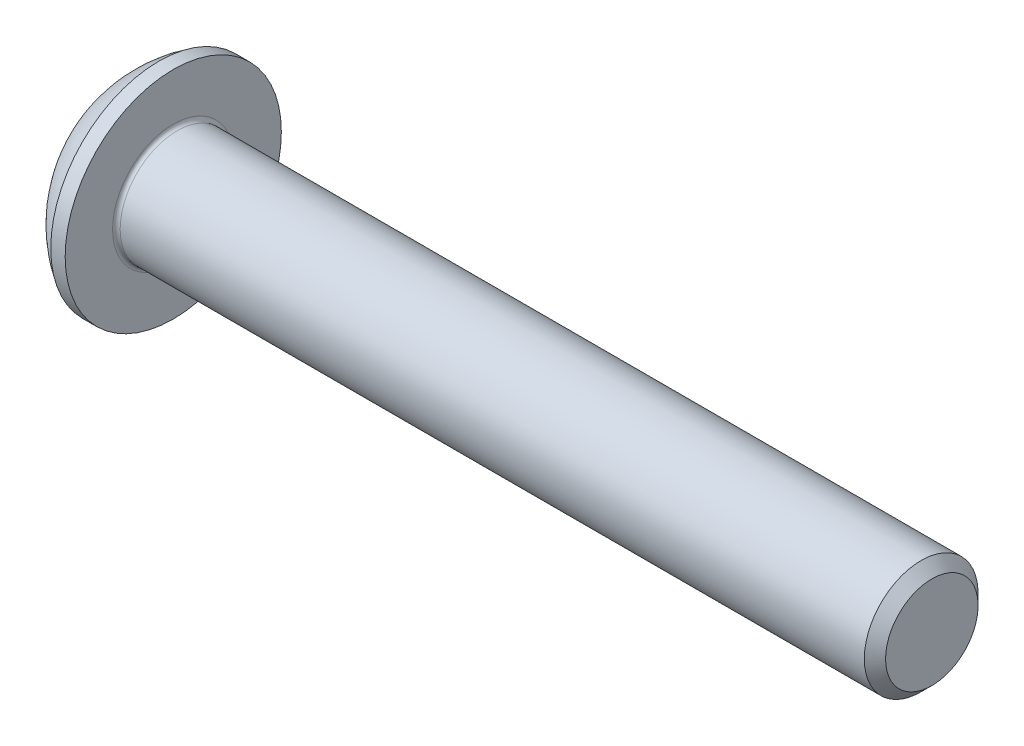
ISO-10303-21;
HEADER;
FILE_DESCRIPTION(('STEP AP214'),'2;1');
FILE_NAME('part.step','',(''),(''),'','','');
FILE_SCHEMA(('AUTOMOTIVE_DESIGN { 1 0 10303 214 1 1 1 1 }'));
ENDSEC;
DATA;
#1=APPLICATION_CONTEXT('core data for automotive mechanical design processes');
#2=APPLICATION_PROTOCOL_DEFINITION('international standard','automotive_design',2000,#1);
#3=PRODUCT_CONTEXT('',#1,'mechanical');
#4=PRODUCT('Part','Part','',(#3));
#5=PRODUCT_RELATED_PRODUCT_CATEGORY('part','',(#4));
#6=PRODUCT_DEFINITION_FORMATION('','',#4);
#7=PRODUCT_DEFINITION_CONTEXT('part definition',#1,'design');
#8=PRODUCT_DEFINITION('design','',#6,#7);
#9=PRODUCT_DEFINITION_SHAPE('','',#8);
#10=(LENGTH_UNIT() NAMED_UNIT(*) SI_UNIT(.MILLI.,.METRE.));
#11=(NAMED_UNIT(*) PLANE_ANGLE_UNIT() SI_UNIT($,.RADIAN.));
#12=(NAMED_UNIT(*) SI_UNIT($,.STERADIAN.) SOLID_ANGLE_UNIT());
#13=UNCERTAINTY_MEASURE_WITH_UNIT(LENGTH_MEASURE(1.E-05),#10,'distance_accuracy_value','');
#14=(GEOMETRIC_REPRESENTATION_CONTEXT(3) GLOBAL_UNCERTAINTY_ASSIGNED_CONTEXT((#13)) GLOBAL_UNIT_ASSIGNED_CONTEXT((#10,
#11,#12)) REPRESENTATION_CONTEXT('',''));
#15=CARTESIAN_POINT('',(0.,0.,0.));
#16=DIRECTION('',(0.,0.,1.));
#17=DIRECTION('',(1.,0.,0.));
#18=AXIS2_PLACEMENT_3D('',#15,#16,#17);
#19=CARTESIAN_POINT('',(0.,0.,0.));
#20=DIRECTION('',(-1.,0.,0.));
#21=DIRECTION('',(0.,0.,1.));
#22=AXIS2_PLACEMENT_3D('',#19,#20,#21);
#23=PLANE('',#22);
#24=CARTESIAN_POINT('',(0.,0.,0.));
#25=DIRECTION('',(-1.,0.,0.));
#26=DIRECTION('',(0.,0.,1.));
#27=AXIS2_PLACEMENT_3D('',#24,#25,#26);
#28=CIRCLE('',#27,1.425);
#29=CARTESIAN_POINT('',(0.,0.,1.425));
#30=VERTEX_POINT('',#29);
#31=EDGE_CURVE('E152',#30,#30,#28,.T.);
#32=ORIENTED_EDGE('',*,*,#31,.T.);
#33=EDGE_LOOP('',(#32));
#34=FACE_BOUND('',#33,.T.);
#35=DIRECTION('',(0.,-1.,0.));
#36=VECTOR('',#35,1.);
#37=CARTESIAN_POINT('',(0.,-0.577350269189625,1.));
#38=LINE('',#37,#36);
#39=CARTESIAN_POINT('',(0.,0.577350269189626,1.));
#40=VERTEX_POINT('',#39);
#41=CARTESIAN_POINT('',(0.,-0.577350269189625,1.));
#42=VERTEX_POINT('',#41);
#43=EDGE_CURVE('E47',#40,#42,#38,.T.);
#44=ORIENTED_EDGE('',*,*,#43,.T.);
#45=DIRECTION('',(0.,-0.5,-0.866025403784439));
#46=VECTOR('',#45,1.);
#47=CARTESIAN_POINT('',(0.,-1.15470053837925,0.));
#48=LINE('',#47,#46);
#49=CARTESIAN_POINT('',(0.,-1.15470053837925,0.));
#50=VERTEX_POINT('',#49);
#51=EDGE_CURVE('E272',#42,#50,#48,.T.);
#52=ORIENTED_EDGE('',*,*,#51,.T.);
#53=DIRECTION('',(0.,0.5,-0.866025403784439));
#54=VECTOR('',#53,1.);
#55=CARTESIAN_POINT('',(0.,-0.577350269189625,-1.));
#56=LINE('',#55,#54);
#57=CARTESIAN_POINT('',(0.,-0.577350269189625,-1.));
#58=VERTEX_POINT('',#57);
#59=EDGE_CURVE('E127',#50,#58,#56,.T.);
#60=ORIENTED_EDGE('',*,*,#59,.T.);
#61=DIRECTION('',(0.,1.,0.));
#62=VECTOR('',#61,1.);
#63=CARTESIAN_POINT('',(0.,0.577350269189626,-1.));
#64=LINE('',#63,#62);
#65=CARTESIAN_POINT('',(0.,0.577350269189626,-1.));
#66=VERTEX_POINT('',#65);
#67=EDGE_CURVE('E275',#58,#66,#64,.T.);
#68=ORIENTED_EDGE('',*,*,#67,.T.);
#69=DIRECTION('',(0.,0.5,0.866025403784439));
#70=VECTOR('',#69,1.);
#71=CARTESIAN_POINT('',(0.,1.15470053837925,0.));
#72=LINE('',#71,#70);
#73=CARTESIAN_POINT('',(0.,1.15470053837925,0.));
#74=VERTEX_POINT('',#73);
#75=EDGE_CURVE('E277',#66,#74,#72,.T.);
#76=ORIENTED_EDGE('',*,*,#75,.T.);
#77=DIRECTION('',(0.,-0.5,0.866025403784439));
#78=VECTOR('',#77,1.);
#79=CARTESIAN_POINT('',(0.,0.577350269189626,1.));
#80=LINE('',#79,#78);
#81=EDGE_CURVE('E279',#74,#40,#80,.T.);
#82=ORIENTED_EDGE('',*,*,#81,.T.);
#83=EDGE_LOOP('',(#44,#52,#60,#68,#76,#82));
#84=FACE_BOUND('',#83,.T.);
#85=ADVANCED_FACE('F32',(#34,#84),#23,.T.);
#86=CARTESIAN_POINT('',(3.03337598425197,0.,0.));
#87=DIRECTION('',(-1.,0.,0.));
#88=DIRECTION('',(0.,1.,0.));
#89=AXIS2_PLACEMENT_3D('',#86,#87,#88);
#90=SPHERICAL_SURFACE('',#89,3.35141684393879);
#91=CARTESIAN_POINT('',(1.27,0.,0.));
#92=DIRECTION('',(-1.,0.,0.));
#93=DIRECTION('',(0.,0.,1.));
#94=AXIS2_PLACEMENT_3D('',#91,#92,#93);
#95=CIRCLE('',#94,2.85);
#96=CARTESIAN_POINT('',(1.27,0.,2.85));
#97=VERTEX_POINT('',#96);
#98=EDGE_CURVE('E149',#97,#97,#95,.T.);
#99=ORIENTED_EDGE('',*,*,#98,.T.);
#100=EDGE_LOOP('',(#99));
#101=FACE_BOUND('',#100,.T.);
#102=ORIENTED_EDGE('',*,*,#31,.F.);
#103=EDGE_LOOP('',(#102));
#104=FACE_BOUND('',#103,.T.);
#105=ADVANCED_FACE('F173',(#101,#104),#90,.T.);
#106=CARTESIAN_POINT('',(0.,0.,0.));
#107=DIRECTION('',(-1.,0.,0.));
#108=DIRECTION('',(0.,0.,1.));
#109=AXIS2_PLACEMENT_3D('',#106,#107,#108);
#110=CYLINDRICAL_SURFACE('',#109,2.85);
#111=ORIENTED_EDGE('',*,*,#98,.F.);
#112=EDGE_LOOP('',(#111));
#113=FACE_BOUND('',#112,.T.);
#114=CARTESIAN_POINT('',(1.65,0.,0.));
#115=DIRECTION('',(-1.,0.,0.));
#116=DIRECTION('',(0.,0.,1.));
#117=AXIS2_PLACEMENT_3D('',#114,#115,#116);
#118=CIRCLE('',#117,2.85);
#119=CARTESIAN_POINT('',(1.65,0.,2.85));
#120=VERTEX_POINT('',#119);
#121=EDGE_CURVE('E146',#120,#120,#118,.T.);
#122=ORIENTED_EDGE('',*,*,#121,.T.);
#123=EDGE_LOOP('',(#122));
#124=FACE_BOUND('',#123,.T.);
#125=ADVANCED_FACE('F178',(#113,#124),#110,.T.);
#126=CARTESIAN_POINT('',(1.65,1.5,0.));
#127=DIRECTION('',(-1.,0.,0.));
#128=DIRECTION('',(0.,0.,1.));
#129=AXIS2_PLACEMENT_3D('',#126,#127,#128);
#130=PLANE('',#129);
#131=CARTESIAN_POINT('',(1.65,0.,0.));
#132=DIRECTION('',(-1.,0.,0.));
#133=DIRECTION('',(0.,0.,1.));
#134=AXIS2_PLACEMENT_3D('',#131,#132,#133);
#135=CIRCLE('',#134,1.6);
#136=CARTESIAN_POINT('',(1.65,0.,1.6));
#137=VERTEX_POINT('',#136);
#138=EDGE_CURVE('E40',#137,#137,#135,.T.);
#139=ORIENTED_EDGE('',*,*,#138,.T.);
#140=EDGE_LOOP('',(#139));
#141=FACE_BOUND('',#140,.T.);
#142=ORIENTED_EDGE('',*,*,#121,.F.);
#143=EDGE_LOOP('',(#142));
#144=FACE_BOUND('',#143,.T.);
#145=ADVANCED_FACE('F157',(#141,#144),#130,.F.);
#146=CARTESIAN_POINT('',(0.,0.,0.));
#147=DIRECTION('',(-1.,0.,0.));
#148=DIRECTION('',(0.,0.,1.));
#149=AXIS2_PLACEMENT_3D('',#146,#147,#148);
#150=CYLINDRICAL_SURFACE('',#149,1.5);
#151=CARTESIAN_POINT('',(1.75,0.,0.));
#152=DIRECTION('',(-1.,0.,0.));
#153=DIRECTION('',(0.,0.,1.));
#154=AXIS2_PLACEMENT_3D('',#151,#152,#153);
#155=CIRCLE('',#154,1.5);
#156=CARTESIAN_POINT('',(1.75,0.,1.5));
#157=VERTEX_POINT('',#156);
#158=EDGE_CURVE('E11',#157,#157,#155,.F.);
#159=ORIENTED_EDGE('',*,*,#158,.T.);
#160=EDGE_LOOP('',(#159));
#161=FACE_BOUND('',#160,.T.);
#162=CARTESIAN_POINT('',(21.3695,0.,0.));
#163=DIRECTION('',(-1.,0.,0.));
#164=DIRECTION('',(0.,0.,1.));
#165=AXIS2_PLACEMENT_3D('',#162,#163,#164);
#166=CIRCLE('',#165,1.5);
#167=CARTESIAN_POINT('',(21.3695,0.,1.5));
#168=VERTEX_POINT('',#167);
#169=EDGE_CURVE('E143',#168,#168,#166,.T.);
#170=ORIENTED_EDGE('',*,*,#169,.T.);
#171=EDGE_LOOP('',(#170));
#172=FACE_BOUND('',#171,.T.);
#173=ADVANCED_FACE('F187',(#161,#172),#150,.T.);
#174=CARTESIAN_POINT('',(21.65,0.,0.));
#175=DIRECTION('',(-1.,0.,0.));
#176=DIRECTION('',(0.,0.,1.));
#177=AXIS2_PLACEMENT_3D('',#174,#175,#176);
#178=CONICAL_SURFACE('',#177,1.2195,0.785398163397452);
#179=ORIENTED_EDGE('',*,*,#169,.F.);
#180=EDGE_LOOP('',(#179));
#181=FACE_BOUND('',#180,.T.);
#182=CARTESIAN_POINT('',(21.65,0.,0.));
#183=DIRECTION('',(-1.,0.,0.));
#184=DIRECTION('',(0.,0.,1.));
#185=AXIS2_PLACEMENT_3D('',#182,#183,#184);
#186=CIRCLE('',#185,1.2195);
#187=CARTESIAN_POINT('',(21.65,0.,1.2195));
#188=VERTEX_POINT('',#187);
#189=EDGE_CURVE('E139',#188,#188,#186,.T.);
#190=ORIENTED_EDGE('',*,*,#189,.T.);
#191=EDGE_LOOP('',(#190));
#192=FACE_BOUND('',#191,.T.);
#193=ADVANCED_FACE('F168',(#181,#192),#178,.T.);
#194=CARTESIAN_POINT('',(21.65,0.,0.));
#195=DIRECTION('',(-1.,0.,0.));
#196=DIRECTION('',(0.,0.,1.));
#197=AXIS2_PLACEMENT_3D('',#194,#195,#196);
#198=PLANE('',#197);
#199=ORIENTED_EDGE('',*,*,#189,.F.);
#200=EDGE_LOOP('',(#199));
#201=FACE_BOUND('',#200,.T.);
#202=ADVANCED_FACE('F161',(#201),#198,.F.);
#203=CARTESIAN_POINT('',(1.75,0.,0.));
#204=DIRECTION('',(-1.,0.,0.));
#205=DIRECTION('',(0.,0.,1.));
#206=AXIS2_PLACEMENT_3D('',#203,#204,#205);
#207=TOROIDAL_SURFACE('',#206,1.6,0.1);
#208=ORIENTED_EDGE('',*,*,#158,.F.);
#209=EDGE_LOOP('',(#208));
#210=FACE_BOUND('',#209,.T.);
#211=ORIENTED_EDGE('',*,*,#138,.F.);
#212=EDGE_LOOP('',(#211));
#213=FACE_BOUND('',#212,.T.);
#214=ADVANCED_FACE('F34',(#210,#213),#207,.F.);
#215=CARTESIAN_POINT('',(1.04,-1.15470053837925,0.));
#216=DIRECTION('',(0.,0.866025403784439,-0.5));
#217=DIRECTION('',(0.,0.5,0.866025403784439));
#218=AXIS2_PLACEMENT_3D('',#215,#216,#217);
#219=PLANE('',#218);
#220=DIRECTION('',(0.,-0.5,-0.866025403784439));
#221=VECTOR('',#220,1.);
#222=CARTESIAN_POINT('',(1.04,-1.15470053837925,0.));
#223=LINE('',#222,#221);
#224=CARTESIAN_POINT('',(1.04,-0.577350269189625,1.));
#225=VERTEX_POINT('',#224);
#226=CARTESIAN_POINT('',(1.04,-0.866025403784438,0.5));
#227=VERTEX_POINT('',#226);
#228=EDGE_CURVE('E113',#225,#227,#223,.T.);
#229=ORIENTED_EDGE('',*,*,#228,.T.);
#230=CARTESIAN_POINT('',(1.04,-1.15470053837925,0.));
#231=VERTEX_POINT('',#230);
#232=EDGE_CURVE('E108',#227,#231,#223,.T.);
#233=ORIENTED_EDGE('',*,*,#232,.T.);
#234=DIRECTION('',(-1.,0.,0.));
#235=VECTOR('',#234,1.);
#236=CARTESIAN_POINT('',(1.04,-1.15470053837925,0.));
#237=LINE('',#236,#235);
#238=EDGE_CURVE('E110',#231,#50,#237,.T.);
#239=ORIENTED_EDGE('',*,*,#238,.T.);
#240=ORIENTED_EDGE('',*,*,#51,.F.);
#241=DIRECTION('',(-1.,0.,0.));
#242=VECTOR('',#241,1.);
#243=CARTESIAN_POINT('',(1.04,-0.577350269189625,1.));
#244=LINE('',#243,#242);
#245=EDGE_CURVE('E268',#225,#42,#244,.T.);
#246=ORIENTED_EDGE('',*,*,#245,.F.);
#247=EDGE_LOOP('',(#229,#233,#239,#240,#246));
#248=FACE_BOUND('',#247,.T.);
#249=ADVANCED_FACE('F109',(#248),#219,.T.);
#250=CARTESIAN_POINT('',(1.04,-0.577350269189625,-1.));
#251=DIRECTION('',(0.,0.866025403784439,0.5));
#252=DIRECTION('',(0.,-0.5,0.866025403784439));
#253=AXIS2_PLACEMENT_3D('',#250,#251,#252);
#254=PLANE('',#253);
#255=DIRECTION('',(0.,0.5,-0.866025403784439));
#256=VECTOR('',#255,1.);
#257=CARTESIAN_POINT('',(1.04,-0.577350269189625,-1.));
#258=LINE('',#257,#256);
#259=CARTESIAN_POINT('',(1.04,-0.866025403784439,-0.5));
#260=VERTEX_POINT('',#259);
#261=EDGE_CURVE('E55',#231,#260,#258,.T.);
#262=ORIENTED_EDGE('',*,*,#261,.T.);
#263=CARTESIAN_POINT('',(1.04,-0.577350269189625,-1.));
#264=VERTEX_POINT('',#263);
#265=EDGE_CURVE('E122',#260,#264,#258,.T.);
#266=ORIENTED_EDGE('',*,*,#265,.T.);
#267=DIRECTION('',(-1.,0.,0.));
#268=VECTOR('',#267,1.);
#269=CARTESIAN_POINT('',(1.04,-0.577350269189625,-1.));
#270=LINE('',#269,#268);
#271=EDGE_CURVE('E129',#264,#58,#270,.T.);
#272=ORIENTED_EDGE('',*,*,#271,.T.);
#273=ORIENTED_EDGE('',*,*,#59,.F.);
#274=ORIENTED_EDGE('',*,*,#238,.F.);
#275=EDGE_LOOP('',(#262,#266,#272,#273,#274));
#276=FACE_BOUND('',#275,.T.);
#277=ADVANCED_FACE('F125',(#276),#254,.T.);
#278=CARTESIAN_POINT('',(1.04,0.577350269189626,-1.));
#279=DIRECTION('',(0.,0.,1.));
#280=DIRECTION('',(1.,0.,0.));
#281=AXIS2_PLACEMENT_3D('',#278,#279,#280);
#282=PLANE('',#281);
#283=DIRECTION('',(0.,1.,0.));
#284=VECTOR('',#283,1.);
#285=CARTESIAN_POINT('',(1.04,0.577350269189626,-1.));
#286=LINE('',#285,#284);
#287=CARTESIAN_POINT('',(1.04,0.,-1.));
#288=VERTEX_POINT('',#287);
#289=EDGE_CURVE('E249',#264,#288,#286,.T.);
#290=ORIENTED_EDGE('',*,*,#289,.T.);
#291=CARTESIAN_POINT('',(1.04,0.577350269189626,-1.));
#292=VERTEX_POINT('',#291);
#293=EDGE_CURVE('E121',#288,#292,#286,.T.);
#294=ORIENTED_EDGE('',*,*,#293,.T.);
#295=DIRECTION('',(-1.,0.,0.));
#296=VECTOR('',#295,1.);
#297=CARTESIAN_POINT('',(1.04,0.577350269189626,-1.));
#298=LINE('',#297,#296);
#299=EDGE_CURVE('E134',#292,#66,#298,.T.);
#300=ORIENTED_EDGE('',*,*,#299,.T.);
#301=ORIENTED_EDGE('',*,*,#67,.F.);
#302=ORIENTED_EDGE('',*,*,#271,.F.);
#303=EDGE_LOOP('',(#290,#294,#300,#301,#302));
#304=FACE_BOUND('',#303,.T.);
#305=ADVANCED_FACE('F201',(#304),#282,.T.);
#306=CARTESIAN_POINT('',(1.04,1.15470053837925,0.));
#307=DIRECTION('',(0.,-0.866025403784439,0.5));
#308=DIRECTION('',(0.,-0.5,-0.866025403784439));
#309=AXIS2_PLACEMENT_3D('',#306,#307,#308);
#310=PLANE('',#309);
#311=DIRECTION('',(0.,0.5,0.866025403784439));
#312=VECTOR('',#311,1.);
#313=CARTESIAN_POINT('',(1.04,1.15470053837925,0.));
#314=LINE('',#313,#312);
#315=CARTESIAN_POINT('',(1.04,0.866025403784439,-0.5));
#316=VERTEX_POINT('',#315);
#317=EDGE_CURVE('E238',#292,#316,#314,.T.);
#318=ORIENTED_EDGE('',*,*,#317,.T.);
#319=CARTESIAN_POINT('',(1.04,1.15470053837925,0.));
#320=VERTEX_POINT('',#319);
#321=EDGE_CURVE('E243',#316,#320,#314,.T.);
#322=ORIENTED_EDGE('',*,*,#321,.T.);
#323=DIRECTION('',(-1.,0.,0.));
#324=VECTOR('',#323,1.);
#325=CARTESIAN_POINT('',(1.04,1.15470053837925,0.));
#326=LINE('',#325,#324);
#327=EDGE_CURVE('E283',#320,#74,#326,.T.);
#328=ORIENTED_EDGE('',*,*,#327,.T.);
#329=ORIENTED_EDGE('',*,*,#75,.F.);
#330=ORIENTED_EDGE('',*,*,#299,.F.);
#331=EDGE_LOOP('',(#318,#322,#328,#329,#330));
#332=FACE_BOUND('',#331,.T.);
#333=ADVANCED_FACE('F204',(#332),#310,.T.);
#334=CARTESIAN_POINT('',(1.04,0.577350269189626,1.));
#335=DIRECTION('',(0.,-0.866025403784439,-0.5));
#336=DIRECTION('',(0.,0.5,-0.866025403784439));
#337=AXIS2_PLACEMENT_3D('',#334,#335,#336);
#338=PLANE('',#337);
#339=DIRECTION('',(0.,-0.5,0.866025403784439));
#340=VECTOR('',#339,1.);
#341=CARTESIAN_POINT('',(1.04,0.577350269189626,1.));
#342=LINE('',#341,#340);
#343=CARTESIAN_POINT('',(1.04,0.866025403784439,0.5));
#344=VERTEX_POINT('',#343);
#345=EDGE_CURVE('E246',#320,#344,#342,.T.);
#346=ORIENTED_EDGE('',*,*,#345,.T.);
#347=CARTESIAN_POINT('',(1.04,0.577350269189626,1.));
#348=VERTEX_POINT('',#347);
#349=EDGE_CURVE('E254',#344,#348,#342,.T.);
#350=ORIENTED_EDGE('',*,*,#349,.T.);
#351=DIRECTION('',(-1.,0.,0.));
#352=VECTOR('',#351,1.);
#353=CARTESIAN_POINT('',(1.04,0.577350269189626,1.));
#354=LINE('',#353,#352);
#355=EDGE_CURVE('E267',#348,#40,#354,.T.);
#356=ORIENTED_EDGE('',*,*,#355,.T.);
#357=ORIENTED_EDGE('',*,*,#81,.F.);
#358=ORIENTED_EDGE('',*,*,#327,.F.);
#359=EDGE_LOOP('',(#346,#350,#356,#357,#358));
#360=FACE_BOUND('',#359,.T.);
#361=ADVANCED_FACE('F208',(#360),#338,.T.);
#362=CARTESIAN_POINT('',(1.04,-0.577350269189625,1.));
#363=DIRECTION('',(0.,0.,-1.));
#364=DIRECTION('',(0.,1.,0.));
#365=AXIS2_PLACEMENT_3D('',#362,#363,#364);
#366=PLANE('',#365);
#367=DIRECTION('',(0.,-1.,0.));
#368=VECTOR('',#367,1.);
#369=CARTESIAN_POINT('',(1.04,-0.577350269189625,1.));
#370=LINE('',#369,#368);
#371=CARTESIAN_POINT('',(1.04,0.,1.));
#372=VERTEX_POINT('',#371);
#373=EDGE_CURVE('E260',#348,#372,#370,.T.);
#374=ORIENTED_EDGE('',*,*,#373,.T.);
#375=EDGE_CURVE('E262',#372,#225,#370,.T.);
#376=ORIENTED_EDGE('',*,*,#375,.T.);
#377=ORIENTED_EDGE('',*,*,#245,.T.);
#378=ORIENTED_EDGE('',*,*,#43,.F.);
#379=ORIENTED_EDGE('',*,*,#355,.F.);
#380=EDGE_LOOP('',(#374,#376,#377,#378,#379));
#381=FACE_BOUND('',#380,.T.);
#382=ADVANCED_FACE('F212',(#381),#366,.T.);
#383=CARTESIAN_POINT('',(1.04,-1.73205080756888,-1.));
#384=DIRECTION('',(1.,0.,0.));
#385=DIRECTION('',(0.,0.,-1.));
#386=AXIS2_PLACEMENT_3D('',#383,#384,#385);
#387=PLANE('',#386);
#388=CARTESIAN_POINT('',(1.04,0.,0.));
#389=DIRECTION('',(-1.,0.,0.));
#390=DIRECTION('',(0.,0.,1.));
#391=AXIS2_PLACEMENT_3D('',#388,#389,#390);
#392=CIRCLE('',#391,1.);
#393=EDGE_CURVE('E235',#316,#288,#392,.T.);
#394=ORIENTED_EDGE('',*,*,#393,.F.);
#395=ORIENTED_EDGE('',*,*,#317,.F.);
#396=ORIENTED_EDGE('',*,*,#293,.F.);
#397=EDGE_LOOP('',(#394,#395,#396));
#398=FACE_BOUND('',#397,.T.);
#399=ADVANCED_FACE('F216',(#398),#387,.F.);
#400=EDGE_CURVE('E140',#344,#316,#392,.T.);
#401=ORIENTED_EDGE('',*,*,#400,.F.);
#402=ORIENTED_EDGE('',*,*,#345,.F.);
#403=ORIENTED_EDGE('',*,*,#321,.F.);
#404=EDGE_LOOP('',(#401,#402,#403));
#405=FACE_BOUND('',#404,.T.);
#406=ADVANCED_FACE('F225',(#405),#387,.F.);
#407=EDGE_CURVE('E133',#372,#344,#392,.T.);
#408=ORIENTED_EDGE('',*,*,#407,.F.);
#409=ORIENTED_EDGE('',*,*,#373,.F.);
#410=ORIENTED_EDGE('',*,*,#349,.F.);
#411=EDGE_LOOP('',(#408,#409,#410));
#412=FACE_BOUND('',#411,.T.);
#413=ADVANCED_FACE('F230',(#412),#387,.F.);
#414=EDGE_CURVE('E128',#227,#372,#392,.T.);
#415=ORIENTED_EDGE('',*,*,#414,.F.);
#416=ORIENTED_EDGE('',*,*,#228,.F.);
#417=ORIENTED_EDGE('',*,*,#375,.F.);
#418=EDGE_LOOP('',(#415,#416,#417));
#419=FACE_BOUND('',#418,.T.);
#420=ADVANCED_FACE('F223',(#419),#387,.F.);
#421=EDGE_CURVE('E119',#260,#227,#392,.T.);
#422=ORIENTED_EDGE('',*,*,#421,.F.);
#423=ORIENTED_EDGE('',*,*,#261,.F.);
#424=ORIENTED_EDGE('',*,*,#232,.F.);
#425=EDGE_LOOP('',(#422,#423,#424));
#426=FACE_BOUND('',#425,.T.);
#427=ADVANCED_FACE('F118',(#426),#387,.F.);
#428=EDGE_CURVE('E241',#288,#260,#392,.T.);
#429=ORIENTED_EDGE('',*,*,#428,.F.);
#430=ORIENTED_EDGE('',*,*,#289,.F.);
#431=ORIENTED_EDGE('',*,*,#265,.F.);
#432=EDGE_LOOP('',(#429,#430,#431));
#433=FACE_BOUND('',#432,.T.);
#434=ADVANCED_FACE('F196',(#433),#387,.F.);
#435=CARTESIAN_POINT('',(1.61735026918963,0.,0.));
#436=DIRECTION('',(-1.,0.,0.));
#437=DIRECTION('',(0.,0.,1.));
#438=AXIS2_PLACEMENT_3D('',#435,#436,#437);
#439=CONICAL_SURFACE('',#438,0.,1.04719755119659);
#440=ORIENTED_EDGE('',*,*,#407,.T.);
#441=ORIENTED_EDGE('',*,*,#400,.T.);
#442=ORIENTED_EDGE('',*,*,#393,.T.);
#443=ORIENTED_EDGE('',*,*,#428,.T.);
#444=ORIENTED_EDGE('',*,*,#421,.T.);
#445=ORIENTED_EDGE('',*,*,#414,.T.);
#446=EDGE_LOOP('',(#440,#441,#442,#443,#444,#445));
#447=FACE_BOUND('',#446,.T.);
#448=CARTESIAN_POINT('',(1.61735026918963,0.,0.));
#449=VERTEX_POINT('',#448);
#450=VERTEX_LOOP('',#449);
#451=FACE_BOUND('',#450,.T.);
#452=ADVANCED_FACE('F194',(#447,#451),#439,.F.);
#453=CLOSED_SHELL('',(#85,#105,#125,#145,#173,#193,#202,#214,#249,#277,#305,#333,#361,#382,#399,
#406,#413,#420,#427,#434,#452));
#454=MANIFOLD_SOLID_BREP('B2',#453);
#455=ADVANCED_BREP_SHAPE_REPRESENTATION('',(#18,#454),#14);
#456=SHAPE_DEFINITION_REPRESENTATION(#9,#455);
ENDSEC;
END-ISO-10303-21;
